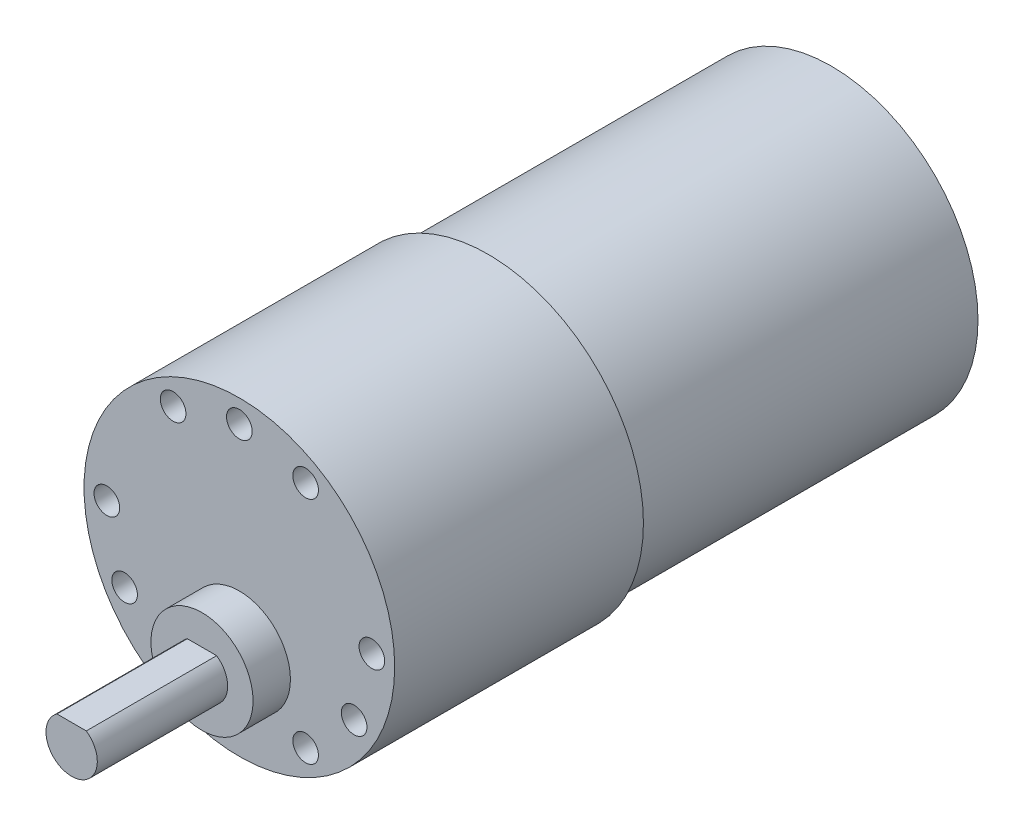
ISO-10303-21;
HEADER;
FILE_DESCRIPTION(('STEP AP214'),'2;1');
FILE_NAME('part.step','',(''),(''),'','','');
FILE_SCHEMA(('AUTOMOTIVE_DESIGN { 1 0 10303 214 1 1 1 1 }'));
ENDSEC;
DATA;
#1=APPLICATION_CONTEXT('core data for automotive mechanical design processes');
#2=APPLICATION_PROTOCOL_DEFINITION('international standard','automotive_design',2000,#1);
#3=PRODUCT_CONTEXT('',#1,'mechanical');
#4=PRODUCT('Part','Part','',(#3));
#5=PRODUCT_RELATED_PRODUCT_CATEGORY('part','',(#4));
#6=PRODUCT_DEFINITION_FORMATION('','',#4);
#7=PRODUCT_DEFINITION_CONTEXT('part definition',#1,'design');
#8=PRODUCT_DEFINITION('design','',#6,#7);
#9=PRODUCT_DEFINITION_SHAPE('','',#8);
#10=(LENGTH_UNIT() NAMED_UNIT(*) SI_UNIT(.MILLI.,.METRE.));
#11=(NAMED_UNIT(*) PLANE_ANGLE_UNIT() SI_UNIT($,.RADIAN.));
#12=(NAMED_UNIT(*) SI_UNIT($,.STERADIAN.) SOLID_ANGLE_UNIT());
#13=UNCERTAINTY_MEASURE_WITH_UNIT(LENGTH_MEASURE(1.E-05),#10,'distance_accuracy_value','');
#14=(GEOMETRIC_REPRESENTATION_CONTEXT(3) GLOBAL_UNCERTAINTY_ASSIGNED_CONTEXT((#13)) GLOBAL_UNIT_ASSIGNED_CONTEXT((#10,
#11,#12)) REPRESENTATION_CONTEXT('',''));
#15=CARTESIAN_POINT('',(0.,0.,0.));
#16=DIRECTION('',(0.,0.,1.));
#17=DIRECTION('',(1.,0.,0.));
#18=AXIS2_PLACEMENT_3D('',#15,#16,#17);
#19=CARTESIAN_POINT('',(0.,0.,-39.116));
#20=DIRECTION('',(0.,0.,-1.));
#21=DIRECTION('',(-1.,0.,0.));
#22=AXIS2_PLACEMENT_3D('',#19,#20,#21);
#23=PLANE('',#22);
#24=DIRECTION('',(0.642787609686543,-0.766044443118975,0.));
#25=VECTOR('',#24,1.);
#26=CARTESIAN_POINT('',(7.15248709016497,-8.91915603771026,-39.116));
#27=LINE('',#26,#25);
#28=CARTESIAN_POINT('',(5.51980656156115,-6.97340315218807,-39.116));
#29=VERTEX_POINT('',#28);
#30=CARTESIAN_POINT('',(7.15248709016497,-8.91915603771026,-39.116));
#31=VERTEX_POINT('',#30);
#32=EDGE_CURVE('E63',#29,#31,#27,.T.);
#33=ORIENTED_EDGE('',*,*,#32,.T.);
#34=DIRECTION('',(-0.766044443118975,-0.642787609686543,0.));
#35=VECTOR('',#34,1.);
#36=CARTESIAN_POINT('',(7.54163766726941,-8.5926199319895,-39.116));
#37=LINE('',#36,#35);
#38=CARTESIAN_POINT('',(7.54163766726941,-8.5926199319895,-39.116));
#39=VERTEX_POINT('',#38);
#40=EDGE_CURVE('E204',#39,#31,#37,.T.);
#41=ORIENTED_EDGE('',*,*,#40,.F.);
#42=DIRECTION('',(0.642787609686543,-0.766044443118975,0.));
#43=VECTOR('',#42,1.);
#44=CARTESIAN_POINT('',(7.54163766726941,-8.5926199319895,-39.116));
#45=LINE('',#44,#43);
#46=CARTESIAN_POINT('',(5.90895713866559,-6.6468670464673,-39.116));
#47=VERTEX_POINT('',#46);
#48=EDGE_CURVE('E179',#47,#39,#45,.T.);
#49=ORIENTED_EDGE('',*,*,#48,.F.);
#50=DIRECTION('',(-0.766044443118975,-0.642787609686543,0.));
#51=VECTOR('',#50,1.);
#52=CARTESIAN_POINT('',(5.90895713866559,-6.6468670464673,-39.116));
#53=LINE('',#52,#51);
#54=EDGE_CURVE('E189',#47,#29,#53,.T.);
#55=ORIENTED_EDGE('',*,*,#54,.T.);
#56=EDGE_LOOP('',(#33,#41,#49,#55));
#57=FACE_BOUND('',#56,.T.);
#58=CARTESIAN_POINT('',(0.,0.,-39.116));
#59=DIRECTION('',(0.,0.,-1.));
#60=DIRECTION('',(-1.,0.,0.));
#61=AXIS2_PLACEMENT_3D('',#58,#59,#60);
#62=CIRCLE('',#61,16.637);
#63=CARTESIAN_POINT('',(-16.637,0.,-39.116));
#64=VERTEX_POINT('',#63);
#65=EDGE_CURVE('E12',#64,#64,#62,.T.);
#66=ORIENTED_EDGE('',*,*,#65,.T.);
#67=EDGE_LOOP('',(#66));
#68=FACE_BOUND('',#67,.T.);
#69=DIRECTION('',(-0.258819045102518,-0.965925826289069,0.));
#70=VECTOR('',#69,1.);
#71=CARTESIAN_POINT('',(-2.87494665811901,-9.7480663576409,-39.116));
#72=LINE('',#71,#70);
#73=CARTESIAN_POINT('',(-2.87494665811901,-9.7480663576409,-39.116));
#74=VERTEX_POINT('',#73);
#75=CARTESIAN_POINT('',(-3.5323470326794,-12.2015179564151,-39.116));
#76=VERTEX_POINT('',#75);
#77=EDGE_CURVE('E55',#74,#76,#72,.T.);
#78=ORIENTED_EDGE('',*,*,#77,.T.);
#79=DIRECTION('',(-0.965925826289069,0.258819045102518,0.));
#80=VECTOR('',#79,1.);
#81=CARTESIAN_POINT('',(-3.04165671292456,-12.3329980313272,-39.116));
#82=LINE('',#81,#80);
#83=CARTESIAN_POINT('',(-3.04165671292456,-12.3329980313272,-39.116));
#84=VERTEX_POINT('',#83);
#85=EDGE_CURVE('E150',#84,#76,#82,.T.);
#86=ORIENTED_EDGE('',*,*,#85,.F.);
#87=DIRECTION('',(-0.258819045102518,-0.965925826289069,0.));
#88=VECTOR('',#87,1.);
#89=CARTESIAN_POINT('',(-2.38425633836416,-9.87954643255298,-39.116));
#90=LINE('',#89,#88);
#91=CARTESIAN_POINT('',(-2.38425633836416,-9.87954643255298,-39.116));
#92=VERTEX_POINT('',#91);
#93=EDGE_CURVE('E156',#92,#84,#90,.T.);
#94=ORIENTED_EDGE('',*,*,#93,.F.);
#95=DIRECTION('',(-0.965925826289069,0.258819045102518,0.));
#96=VECTOR('',#95,1.);
#97=CARTESIAN_POINT('',(-2.38425633836416,-9.87954643255298,-39.116));
#98=LINE('',#97,#96);
#99=EDGE_CURVE('E521',#92,#74,#98,.T.);
#100=ORIENTED_EDGE('',*,*,#99,.T.);
#101=EDGE_LOOP('',(#78,#86,#94,#100));
#102=FACE_BOUND('',#101,.T.);
#103=ADVANCED_FACE('F41',(#57,#68,#102),#23,.T.);
#104=CARTESIAN_POINT('',(0.,0.,-40.132));
#105=DIRECTION('',(0.,0.,-1.));
#106=DIRECTION('',(-1.,0.,0.));
#107=AXIS2_PLACEMENT_3D('',#104,#105,#106);
#108=PLANE('',#107);
#109=CARTESIAN_POINT('',(0.,0.,-40.132));
#110=DIRECTION('',(0.,0.,-1.));
#111=DIRECTION('',(-1.,0.,0.));
#112=AXIS2_PLACEMENT_3D('',#109,#110,#111);
#113=CIRCLE('',#112,16.637);
#114=CARTESIAN_POINT('',(-16.637,0.,-40.132));
#115=VERTEX_POINT('',#114);
#116=EDGE_CURVE('E48',#115,#115,#113,.T.);
#117=ORIENTED_EDGE('',*,*,#116,.F.);
#118=EDGE_LOOP('',(#117));
#119=FACE_BOUND('',#118,.T.);
#120=CARTESIAN_POINT('',(0.,0.,-40.132));
#121=DIRECTION('',(0.,0.,-1.));
#122=DIRECTION('',(-1.,0.,0.));
#123=AXIS2_PLACEMENT_3D('',#120,#121,#122);
#124=CIRCLE('',#123,17.145);
#125=CARTESIAN_POINT('',(-17.145,0.,-40.132));
#126=VERTEX_POINT('',#125);
#127=EDGE_CURVE('E207',#126,#126,#124,.T.);
#128=ORIENTED_EDGE('',*,*,#127,.T.);
#129=EDGE_LOOP('',(#128));
#130=FACE_BOUND('',#129,.T.);
#131=ADVANCED_FACE('F298',(#119,#130),#108,.T.);
#132=CARTESIAN_POINT('',(0.,0.,0.));
#133=DIRECTION('',(0.,0.,1.));
#134=DIRECTION('',(1.,0.,0.));
#135=AXIS2_PLACEMENT_3D('',#132,#133,#134);
#136=PLANE('',#135);
#137=CARTESIAN_POINT('',(0.,0.,0.));
#138=DIRECTION('',(0.,0.,1.));
#139=DIRECTION('',(1.,0.,0.));
#140=AXIS2_PLACEMENT_3D('',#137,#138,#139);
#141=CIRCLE('',#140,18.161);
#142=CARTESIAN_POINT('',(18.161,0.,0.));
#143=VERTEX_POINT('',#142);
#144=EDGE_CURVE('E212',#143,#143,#141,.T.);
#145=ORIENTED_EDGE('',*,*,#144,.F.);
#146=EDGE_LOOP('',(#145));
#147=FACE_BOUND('',#146,.T.);
#148=CARTESIAN_POINT('',(0.,0.,0.));
#149=DIRECTION('',(0.,0.,1.));
#150=DIRECTION('',(1.,0.,0.));
#151=AXIS2_PLACEMENT_3D('',#148,#149,#150);
#152=CIRCLE('',#151,17.145);
#153=CARTESIAN_POINT('',(17.145,0.,0.));
#154=VERTEX_POINT('',#153);
#155=EDGE_CURVE('E208',#154,#154,#152,.F.);
#156=ORIENTED_EDGE('',*,*,#155,.F.);
#157=EDGE_LOOP('',(#156));
#158=FACE_BOUND('',#157,.T.);
#159=ADVANCED_FACE('F301',(#147,#158),#136,.F.);
#160=CARTESIAN_POINT('',(0.,-7.366,33.4518));
#161=DIRECTION('',(0.,0.,1.));
#162=DIRECTION('',(1.,0.,0.));
#163=AXIS2_PLACEMENT_3D('',#160,#161,#162);
#164=PLANE('',#163);
#165=CARTESIAN_POINT('',(0.,-7.366,33.4518));
#166=DIRECTION('',(0.,0.,1.));
#167=DIRECTION('',(1.,0.,0.));
#168=AXIS2_PLACEMENT_3D('',#165,#166,#167);
#169=CIRCLE('',#168,5.969);
#170=CARTESIAN_POINT('',(5.969,-7.366,33.4518));
#171=VERTEX_POINT('',#170);
#172=EDGE_CURVE('E219',#171,#171,#169,.T.);
#173=ORIENTED_EDGE('',*,*,#172,.T.);
#174=EDGE_LOOP('',(#173));
#175=FACE_BOUND('',#174,.T.);
#176=DIRECTION('',(-1.,0.,0.));
#177=VECTOR('',#176,1.);
#178=CARTESIAN_POINT('',(-1.71565701700544,-4.905,33.4518));
#179=LINE('',#178,#177);
#180=CARTESIAN_POINT('',(1.71565701700544,-4.905,33.4518));
#181=VERTEX_POINT('',#180);
#182=CARTESIAN_POINT('',(-1.71565701700544,-4.905,33.4518));
#183=VERTEX_POINT('',#182);
#184=EDGE_CURVE('E229',#181,#183,#179,.T.);
#185=ORIENTED_EDGE('',*,*,#184,.F.);
#186=CARTESIAN_POINT('',(0.,-7.366,33.4518));
#187=DIRECTION('',(0.,0.,1.));
#188=DIRECTION('',(1.,0.,0.));
#189=AXIS2_PLACEMENT_3D('',#186,#187,#188);
#190=CIRCLE('',#189,3.);
#191=EDGE_CURVE('E222',#183,#181,#190,.T.);
#192=ORIENTED_EDGE('',*,*,#191,.F.);
#193=EDGE_LOOP('',(#185,#192));
#194=FACE_BOUND('',#193,.T.);
#195=ADVANCED_FACE('F313',(#175,#194),#164,.T.);
#196=CARTESIAN_POINT('',(0.,0.,29.083));
#197=DIRECTION('',(0.,0.,1.));
#198=DIRECTION('',(1.,0.,0.));
#199=AXIS2_PLACEMENT_3D('',#196,#197,#198);
#200=PLANE('',#199);
#201=CARTESIAN_POINT('',(-7.74699999999983,13.4181976062362,29.083));
#202=DIRECTION('',(0.,0.,1.));
#203=DIRECTION('',(1.,0.,0.));
#204=AXIS2_PLACEMENT_3D('',#201,#202,#203);
#205=CIRCLE('',#204,1.49999999999999);
#206=CARTESIAN_POINT('',(-6.24699999999984,13.4181976062362,29.083));
#207=VERTEX_POINT('',#206);
#208=EDGE_CURVE('E211',#207,#207,#205,.T.);
#209=ORIENTED_EDGE('',*,*,#208,.F.);
#210=EDGE_LOOP('',(#209));
#211=FACE_BOUND('',#210,.T.);
#212=CARTESIAN_POINT('',(-15.494,1.62291035592107E-13,29.083));
#213=DIRECTION('',(0.,0.,1.));
#214=DIRECTION('',(1.,0.,0.));
#215=AXIS2_PLACEMENT_3D('',#212,#213,#214);
#216=CIRCLE('',#215,1.49999999999999);
#217=CARTESIAN_POINT('',(-13.994,1.62291035592107E-13,29.083));
#218=VERTEX_POINT('',#217);
#219=EDGE_CURVE('E284',#218,#218,#216,.T.);
#220=ORIENTED_EDGE('',*,*,#219,.F.);
#221=EDGE_LOOP('',(#220));
#222=FACE_BOUND('',#221,.T.);
#223=CARTESIAN_POINT('',(-13.4181976062362,-7.74699999999987,29.083));
#224=DIRECTION('',(0.,0.,1.));
#225=DIRECTION('',(1.,0.,0.));
#226=AXIS2_PLACEMENT_3D('',#223,#224,#225);
#227=CIRCLE('',#226,1.49999999999999);
#228=CARTESIAN_POINT('',(-11.9181976062362,-7.74699999999987,29.083));
#229=VERTEX_POINT('',#228);
#230=EDGE_CURVE('E278',#229,#229,#227,.T.);
#231=ORIENTED_EDGE('',*,*,#230,.F.);
#232=EDGE_LOOP('',(#231));
#233=FACE_BOUND('',#232,.T.);
#234=CARTESIAN_POINT('',(-7.74700000000011,-13.418197606236,29.083));
#235=DIRECTION('',(0.,0.,1.));
#236=DIRECTION('',(1.,0.,0.));
#237=AXIS2_PLACEMENT_3D('',#234,#235,#236);
#238=CIRCLE('',#237,1.49999999999999);
#239=CARTESIAN_POINT('',(-6.24700000000012,-13.418197606236,29.083));
#240=VERTEX_POINT('',#239);
#241=EDGE_CURVE('E272',#240,#240,#238,.T.);
#242=ORIENTED_EDGE('',*,*,#241,.F.);
#243=EDGE_LOOP('',(#242));
#244=FACE_BOUND('',#243,.T.);
#245=CARTESIAN_POINT('',(7.74699999999992,-13.4181976062361,29.083));
#246=DIRECTION('',(0.,0.,1.));
#247=DIRECTION('',(1.,0.,0.));
#248=AXIS2_PLACEMENT_3D('',#245,#246,#247);
#249=CIRCLE('',#248,1.49999999999999);
#250=CARTESIAN_POINT('',(9.24699999999991,-13.4181976062361,29.083));
#251=VERTEX_POINT('',#250);
#252=EDGE_CURVE('E266',#251,#251,#249,.T.);
#253=ORIENTED_EDGE('',*,*,#252,.F.);
#254=EDGE_LOOP('',(#253));
#255=FACE_BOUND('',#254,.T.);
#256=CARTESIAN_POINT('',(13.4181976062361,-7.74700000000006,29.083));
#257=DIRECTION('',(0.,0.,1.));
#258=DIRECTION('',(1.,0.,0.));
#259=AXIS2_PLACEMENT_3D('',#256,#257,#258);
#260=CIRCLE('',#259,1.49999999999999);
#261=CARTESIAN_POINT('',(14.918197606236,-7.74700000000006,29.083));
#262=VERTEX_POINT('',#261);
#263=EDGE_CURVE('E260',#262,#262,#260,.T.);
#264=ORIENTED_EDGE('',*,*,#263,.F.);
#265=EDGE_LOOP('',(#264));
#266=FACE_BOUND('',#265,.T.);
#267=CARTESIAN_POINT('',(15.494,0.,29.083));
#268=DIRECTION('',(0.,0.,1.));
#269=DIRECTION('',(1.,0.,0.));
#270=AXIS2_PLACEMENT_3D('',#267,#268,#269);
#271=CIRCLE('',#270,1.49999999999999);
#272=CARTESIAN_POINT('',(16.994,0.,29.083));
#273=VERTEX_POINT('',#272);
#274=EDGE_CURVE('E254',#273,#273,#271,.T.);
#275=ORIENTED_EDGE('',*,*,#274,.F.);
#276=EDGE_LOOP('',(#275));
#277=FACE_BOUND('',#276,.T.);
#278=CARTESIAN_POINT('',(7.74700000000001,13.4181976062361,29.083));
#279=DIRECTION('',(0.,0.,1.));
#280=DIRECTION('',(1.,0.,0.));
#281=AXIS2_PLACEMENT_3D('',#278,#279,#280);
#282=CIRCLE('',#281,1.49999999999999);
#283=CARTESIAN_POINT('',(9.24700000000001,13.4181976062361,29.083));
#284=VERTEX_POINT('',#283);
#285=EDGE_CURVE('E248',#284,#284,#282,.T.);
#286=ORIENTED_EDGE('',*,*,#285,.F.);
#287=EDGE_LOOP('',(#286));
#288=FACE_BOUND('',#287,.T.);
#289=CARTESIAN_POINT('',(0.,15.494,29.083));
#290=DIRECTION('',(0.,0.,1.));
#291=DIRECTION('',(1.,0.,0.));
#292=AXIS2_PLACEMENT_3D('',#289,#290,#291);
#293=CIRCLE('',#292,1.49999999999999);
#294=CARTESIAN_POINT('',(1.49999999999999,15.494,29.083));
#295=VERTEX_POINT('',#294);
#296=EDGE_CURVE('E242',#295,#295,#293,.T.);
#297=ORIENTED_EDGE('',*,*,#296,.F.);
#298=EDGE_LOOP('',(#297));
#299=FACE_BOUND('',#298,.T.);
#300=CARTESIAN_POINT('',(0.,0.,29.083));
#301=DIRECTION('',(0.,0.,1.));
#302=DIRECTION('',(1.,0.,0.));
#303=AXIS2_PLACEMENT_3D('',#300,#301,#302);
#304=CIRCLE('',#303,18.161);
#305=CARTESIAN_POINT('',(18.161,0.,29.083));
#306=VERTEX_POINT('',#305);
#307=EDGE_CURVE('E216',#306,#306,#304,.T.);
#308=ORIENTED_EDGE('',*,*,#307,.T.);
#309=EDGE_LOOP('',(#308));
#310=FACE_BOUND('',#309,.T.);
#311=CARTESIAN_POINT('',(0.,-7.366,29.083));
#312=DIRECTION('',(0.,0.,1.));
#313=DIRECTION('',(1.,0.,0.));
#314=AXIS2_PLACEMENT_3D('',#311,#312,#313);
#315=CIRCLE('',#314,5.969);
#316=CARTESIAN_POINT('',(5.969,-7.366,29.083));
#317=VERTEX_POINT('',#316);
#318=EDGE_CURVE('E215',#317,#317,#315,.T.);
#319=ORIENTED_EDGE('',*,*,#318,.F.);
#320=EDGE_LOOP('',(#319));
#321=FACE_BOUND('',#320,.T.);
#322=ADVANCED_FACE('F319',(#211,#222,#233,#244,#255,#266,#277,#288,#299,#310,#321),#200,.T.);
#323=CARTESIAN_POINT('',(0.,0.,29.083));
#324=DIRECTION('',(0.,0.,-1.));
#325=DIRECTION('',(-1.,0.,0.));
#326=AXIS2_PLACEMENT_3D('',#323,#324,#325);
#327=CYLINDRICAL_SURFACE('',#326,18.161);
#328=ORIENTED_EDGE('',*,*,#307,.F.);
#329=EDGE_LOOP('',(#328));
#330=FACE_BOUND('',#329,.T.);
#331=ORIENTED_EDGE('',*,*,#144,.T.);
#332=EDGE_LOOP('',(#331));
#333=FACE_BOUND('',#332,.T.);
#334=ADVANCED_FACE('F427',(#330,#333),#327,.T.);
#335=CARTESIAN_POINT('',(0.,-7.366,33.4518));
#336=DIRECTION('',(0.,0.,-1.));
#337=DIRECTION('',(-1.,0.,0.));
#338=AXIS2_PLACEMENT_3D('',#335,#336,#337);
#339=CYLINDRICAL_SURFACE('',#338,5.969);
#340=ORIENTED_EDGE('',*,*,#172,.F.);
#341=EDGE_LOOP('',(#340));
#342=FACE_BOUND('',#341,.T.);
#343=ORIENTED_EDGE('',*,*,#318,.T.);
#344=EDGE_LOOP('',(#343));
#345=FACE_BOUND('',#344,.T.);
#346=ADVANCED_FACE('F423',(#342,#345),#339,.T.);
#347=CARTESIAN_POINT('',(0.,-7.366,48.6918));
#348=DIRECTION('',(0.,0.,-1.));
#349=DIRECTION('',(-1.,0.,0.));
#350=AXIS2_PLACEMENT_3D('',#347,#348,#349);
#351=CYLINDRICAL_SURFACE('',#350,3.);
#352=ORIENTED_EDGE('',*,*,#191,.T.);
#353=DIRECTION('',(0.,0.,-1.));
#354=VECTOR('',#353,1.);
#355=CARTESIAN_POINT('',(1.71565701700544,-4.905,48.6918));
#356=LINE('',#355,#354);
#357=CARTESIAN_POINT('',(1.71565701700544,-4.905,48.6918));
#358=VERTEX_POINT('',#357);
#359=EDGE_CURVE('E225',#358,#181,#356,.T.);
#360=ORIENTED_EDGE('',*,*,#359,.F.);
#361=CARTESIAN_POINT('',(0.,-7.366,48.6918));
#362=DIRECTION('',(0.,0.,1.));
#363=DIRECTION('',(1.,0.,0.));
#364=AXIS2_PLACEMENT_3D('',#361,#362,#363);
#365=CIRCLE('',#364,3.);
#366=CARTESIAN_POINT('',(-1.71565701700544,-4.905,48.6918));
#367=VERTEX_POINT('',#366);
#368=EDGE_CURVE('E228',#367,#358,#365,.T.);
#369=ORIENTED_EDGE('',*,*,#368,.F.);
#370=DIRECTION('',(0.,0.,-1.));
#371=VECTOR('',#370,1.);
#372=CARTESIAN_POINT('',(-1.71565701700544,-4.905,48.6918));
#373=LINE('',#372,#371);
#374=EDGE_CURVE('E230',#367,#183,#373,.T.);
#375=ORIENTED_EDGE('',*,*,#374,.T.);
#376=EDGE_LOOP('',(#352,#360,#369,#375));
#377=FACE_BOUND('',#376,.T.);
#378=ADVANCED_FACE('F420',(#377),#351,.T.);
#379=CARTESIAN_POINT('',(-1.71565701700544,-4.905,48.6918));
#380=DIRECTION('',(0.,-1.,0.));
#381=DIRECTION('',(0.,0.,-1.));
#382=AXIS2_PLACEMENT_3D('',#379,#380,#381);
#383=PLANE('',#382);
#384=ORIENTED_EDGE('',*,*,#184,.T.);
#385=ORIENTED_EDGE('',*,*,#374,.F.);
#386=DIRECTION('',(-1.,0.,0.));
#387=VECTOR('',#386,1.);
#388=CARTESIAN_POINT('',(-1.71565701700544,-4.905,48.6918));
#389=LINE('',#388,#387);
#390=EDGE_CURVE('E235',#358,#367,#389,.T.);
#391=ORIENTED_EDGE('',*,*,#390,.F.);
#392=ORIENTED_EDGE('',*,*,#359,.T.);
#393=EDGE_LOOP('',(#384,#385,#391,#392));
#394=FACE_BOUND('',#393,.T.);
#395=ADVANCED_FACE('F416',(#394),#383,.F.);
#396=CARTESIAN_POINT('',(0.,-7.366,48.6918));
#397=DIRECTION('',(0.,0.,1.));
#398=DIRECTION('',(1.,0.,0.));
#399=AXIS2_PLACEMENT_3D('',#396,#397,#398);
#400=PLANE('',#399);
#401=ORIENTED_EDGE('',*,*,#368,.T.);
#402=ORIENTED_EDGE('',*,*,#390,.T.);
#403=EDGE_LOOP('',(#401,#402));
#404=FACE_BOUND('',#403,.T.);
#405=ADVANCED_FACE('F412',(#404),#400,.T.);
#406=CARTESIAN_POINT('',(0.,15.494,18.923));
#407=DIRECTION('',(0.,0.,1.));
#408=DIRECTION('',(1.,0.,0.));
#409=AXIS2_PLACEMENT_3D('',#406,#407,#408);
#410=CONICAL_SURFACE('',#409,1.49999999999999,1.02974425867665);
#411=CARTESIAN_POINT('',(0.,15.494,18.0217090714587));
#412=VERTEX_POINT('',#411);
#413=VERTEX_LOOP('',#412);
#414=FACE_BOUND('',#413,.T.);
#415=CARTESIAN_POINT('',(0.,15.494,18.923));
#416=DIRECTION('',(0.,0.,1.));
#417=DIRECTION('',(1.,0.,0.));
#418=AXIS2_PLACEMENT_3D('',#415,#416,#417);
#419=CIRCLE('',#418,1.49999999999999);
#420=CARTESIAN_POINT('',(1.49999999999999,15.494,18.923));
#421=VERTEX_POINT('',#420);
#422=EDGE_CURVE('E237',#421,#421,#419,.T.);
#423=ORIENTED_EDGE('',*,*,#422,.T.);
#424=EDGE_LOOP('',(#423));
#425=FACE_BOUND('',#424,.T.);
#426=ADVANCED_FACE('F408',(#414,#425),#410,.F.);
#427=CARTESIAN_POINT('',(0.,15.494,29.083));
#428=DIRECTION('',(0.,0.,1.));
#429=DIRECTION('',(1.,0.,0.));
#430=AXIS2_PLACEMENT_3D('',#427,#428,#429);
#431=CYLINDRICAL_SURFACE('',#430,1.49999999999999);
#432=ORIENTED_EDGE('',*,*,#422,.F.);
#433=EDGE_LOOP('',(#432));
#434=FACE_BOUND('',#433,.T.);
#435=ORIENTED_EDGE('',*,*,#296,.T.);
#436=EDGE_LOOP('',(#435));
#437=FACE_BOUND('',#436,.T.);
#438=ADVANCED_FACE('F404',(#434,#437),#431,.F.);
#439=CARTESIAN_POINT('',(7.74700000000001,13.4181976062361,18.923));
#440=DIRECTION('',(0.,0.,1.));
#441=DIRECTION('',(1.,0.,0.));
#442=AXIS2_PLACEMENT_3D('',#439,#440,#441);
#443=CONICAL_SURFACE('',#442,1.49999999999999,1.02974425867665);
#444=CARTESIAN_POINT('',(7.74700000000001,13.4181976062361,18.0217090714587));
#445=VERTEX_POINT('',#444);
#446=VERTEX_LOOP('',#445);
#447=FACE_BOUND('',#446,.T.);
#448=CARTESIAN_POINT('',(7.74700000000001,13.4181976062361,18.923));
#449=DIRECTION('',(0.,0.,1.));
#450=DIRECTION('',(1.,0.,0.));
#451=AXIS2_PLACEMENT_3D('',#448,#449,#450);
#452=CIRCLE('',#451,1.49999999999999);
#453=CARTESIAN_POINT('',(9.247,13.4181976062361,18.923));
#454=VERTEX_POINT('',#453);
#455=EDGE_CURVE('E245',#454,#454,#452,.T.);
#456=ORIENTED_EDGE('',*,*,#455,.T.);
#457=EDGE_LOOP('',(#456));
#458=FACE_BOUND('',#457,.T.);
#459=ADVANCED_FACE('F400',(#447,#458),#443,.F.);
#460=CARTESIAN_POINT('',(7.74700000000001,13.4181976062361,29.083));
#461=DIRECTION('',(0.,0.,1.));
#462=DIRECTION('',(1.,0.,0.));
#463=AXIS2_PLACEMENT_3D('',#460,#461,#462);
#464=CYLINDRICAL_SURFACE('',#463,1.49999999999999);
#465=ORIENTED_EDGE('',*,*,#455,.F.);
#466=EDGE_LOOP('',(#465));
#467=FACE_BOUND('',#466,.T.);
#468=ORIENTED_EDGE('',*,*,#285,.T.);
#469=EDGE_LOOP('',(#468));
#470=FACE_BOUND('',#469,.T.);
#471=ADVANCED_FACE('F396',(#467,#470),#464,.F.);
#472=CARTESIAN_POINT('',(15.494,0.,18.923));
#473=DIRECTION('',(0.,0.,1.));
#474=DIRECTION('',(1.,0.,0.));
#475=AXIS2_PLACEMENT_3D('',#472,#473,#474);
#476=CONICAL_SURFACE('',#475,1.49999999999999,1.02974425867665);
#477=CARTESIAN_POINT('',(15.494,0.,18.0217090714587));
#478=VERTEX_POINT('',#477);
#479=VERTEX_LOOP('',#478);
#480=FACE_BOUND('',#479,.T.);
#481=CARTESIAN_POINT('',(15.494,0.,18.923));
#482=DIRECTION('',(0.,0.,1.));
#483=DIRECTION('',(1.,0.,0.));
#484=AXIS2_PLACEMENT_3D('',#481,#482,#483);
#485=CIRCLE('',#484,1.49999999999999);
#486=CARTESIAN_POINT('',(16.994,0.,18.923));
#487=VERTEX_POINT('',#486);
#488=EDGE_CURVE('E251',#487,#487,#485,.T.);
#489=ORIENTED_EDGE('',*,*,#488,.T.);
#490=EDGE_LOOP('',(#489));
#491=FACE_BOUND('',#490,.T.);
#492=ADVANCED_FACE('F392',(#480,#491),#476,.F.);
#493=CARTESIAN_POINT('',(15.494,0.,29.083));
#494=DIRECTION('',(0.,0.,1.));
#495=DIRECTION('',(1.,0.,0.));
#496=AXIS2_PLACEMENT_3D('',#493,#494,#495);
#497=CYLINDRICAL_SURFACE('',#496,1.49999999999999);
#498=ORIENTED_EDGE('',*,*,#488,.F.);
#499=EDGE_LOOP('',(#498));
#500=FACE_BOUND('',#499,.T.);
#501=ORIENTED_EDGE('',*,*,#274,.T.);
#502=EDGE_LOOP('',(#501));
#503=FACE_BOUND('',#502,.T.);
#504=ADVANCED_FACE('F388',(#500,#503),#497,.F.);
#505=CARTESIAN_POINT('',(13.4181976062361,-7.74700000000006,18.923));
#506=DIRECTION('',(0.,0.,1.));
#507=DIRECTION('',(1.,0.,0.));
#508=AXIS2_PLACEMENT_3D('',#505,#506,#507);
#509=CONICAL_SURFACE('',#508,1.49999999999999,1.02974425867665);
#510=CARTESIAN_POINT('',(13.4181976062361,-7.74700000000006,18.0217090714587));
#511=VERTEX_POINT('',#510);
#512=VERTEX_LOOP('',#511);
#513=FACE_BOUND('',#512,.T.);
#514=CARTESIAN_POINT('',(13.4181976062361,-7.74700000000006,18.923));
#515=DIRECTION('',(0.,0.,1.));
#516=DIRECTION('',(1.,0.,0.));
#517=AXIS2_PLACEMENT_3D('',#514,#515,#516);
#518=CIRCLE('',#517,1.49999999999999);
#519=CARTESIAN_POINT('',(14.918197606236,-7.74700000000006,18.923));
#520=VERTEX_POINT('',#519);
#521=EDGE_CURVE('E257',#520,#520,#518,.T.);
#522=ORIENTED_EDGE('',*,*,#521,.T.);
#523=EDGE_LOOP('',(#522));
#524=FACE_BOUND('',#523,.T.);
#525=ADVANCED_FACE('F384',(#513,#524),#509,.F.);
#526=CARTESIAN_POINT('',(13.4181976062361,-7.74700000000006,29.083));
#527=DIRECTION('',(0.,0.,1.));
#528=DIRECTION('',(1.,0.,0.));
#529=AXIS2_PLACEMENT_3D('',#526,#527,#528);
#530=CYLINDRICAL_SURFACE('',#529,1.49999999999999);
#531=ORIENTED_EDGE('',*,*,#521,.F.);
#532=EDGE_LOOP('',(#531));
#533=FACE_BOUND('',#532,.T.);
#534=ORIENTED_EDGE('',*,*,#263,.T.);
#535=EDGE_LOOP('',(#534));
#536=FACE_BOUND('',#535,.T.);
#537=ADVANCED_FACE('F380',(#533,#536),#530,.F.);
#538=CARTESIAN_POINT('',(7.74699999999992,-13.4181976062361,18.923));
#539=DIRECTION('',(0.,0.,1.));
#540=DIRECTION('',(1.,0.,0.));
#541=AXIS2_PLACEMENT_3D('',#538,#539,#540);
#542=CONICAL_SURFACE('',#541,1.49999999999999,1.02974425867665);
#543=CARTESIAN_POINT('',(7.74699999999992,-13.4181976062361,18.0217090714587));
#544=VERTEX_POINT('',#543);
#545=VERTEX_LOOP('',#544);
#546=FACE_BOUND('',#545,.T.);
#547=CARTESIAN_POINT('',(7.74699999999992,-13.4181976062361,18.923));
#548=DIRECTION('',(0.,0.,1.));
#549=DIRECTION('',(1.,0.,0.));
#550=AXIS2_PLACEMENT_3D('',#547,#548,#549);
#551=CIRCLE('',#550,1.49999999999999);
#552=CARTESIAN_POINT('',(9.24699999999991,-13.4181976062361,18.923));
#553=VERTEX_POINT('',#552);
#554=EDGE_CURVE('E263',#553,#553,#551,.T.);
#555=ORIENTED_EDGE('',*,*,#554,.T.);
#556=EDGE_LOOP('',(#555));
#557=FACE_BOUND('',#556,.T.);
#558=ADVANCED_FACE('F376',(#546,#557),#542,.F.);
#559=CARTESIAN_POINT('',(7.74699999999992,-13.4181976062361,29.083));
#560=DIRECTION('',(0.,0.,1.));
#561=DIRECTION('',(1.,0.,0.));
#562=AXIS2_PLACEMENT_3D('',#559,#560,#561);
#563=CYLINDRICAL_SURFACE('',#562,1.49999999999999);
#564=ORIENTED_EDGE('',*,*,#554,.F.);
#565=EDGE_LOOP('',(#564));
#566=FACE_BOUND('',#565,.T.);
#567=ORIENTED_EDGE('',*,*,#252,.T.);
#568=EDGE_LOOP('',(#567));
#569=FACE_BOUND('',#568,.T.);
#570=ADVANCED_FACE('F372',(#566,#569),#563,.F.);
#571=CARTESIAN_POINT('',(-7.74700000000011,-13.418197606236,18.923));
#572=DIRECTION('',(0.,0.,1.));
#573=DIRECTION('',(1.,0.,0.));
#574=AXIS2_PLACEMENT_3D('',#571,#572,#573);
#575=CONICAL_SURFACE('',#574,1.49999999999999,1.02974425867665);
#576=CARTESIAN_POINT('',(-7.74700000000011,-13.418197606236,18.0217090714587));
#577=VERTEX_POINT('',#576);
#578=VERTEX_LOOP('',#577);
#579=FACE_BOUND('',#578,.T.);
#580=CARTESIAN_POINT('',(-7.74700000000011,-13.418197606236,18.923));
#581=DIRECTION('',(0.,0.,1.));
#582=DIRECTION('',(1.,0.,0.));
#583=AXIS2_PLACEMENT_3D('',#580,#581,#582);
#584=CIRCLE('',#583,1.49999999999999);
#585=CARTESIAN_POINT('',(-6.24700000000012,-13.418197606236,18.923));
#586=VERTEX_POINT('',#585);
#587=EDGE_CURVE('E269',#586,#586,#584,.T.);
#588=ORIENTED_EDGE('',*,*,#587,.T.);
#589=EDGE_LOOP('',(#588));
#590=FACE_BOUND('',#589,.T.);
#591=ADVANCED_FACE('F368',(#579,#590),#575,.F.);
#592=CARTESIAN_POINT('',(-7.74700000000011,-13.418197606236,29.083));
#593=DIRECTION('',(0.,0.,1.));
#594=DIRECTION('',(1.,0.,0.));
#595=AXIS2_PLACEMENT_3D('',#592,#593,#594);
#596=CYLINDRICAL_SURFACE('',#595,1.49999999999999);
#597=ORIENTED_EDGE('',*,*,#587,.F.);
#598=EDGE_LOOP('',(#597));
#599=FACE_BOUND('',#598,.T.);
#600=ORIENTED_EDGE('',*,*,#241,.T.);
#601=EDGE_LOOP('',(#600));
#602=FACE_BOUND('',#601,.T.);
#603=ADVANCED_FACE('F364',(#599,#602),#596,.F.);
#604=CARTESIAN_POINT('',(-13.4181976062362,-7.74699999999987,18.923));
#605=DIRECTION('',(0.,0.,1.));
#606=DIRECTION('',(1.,0.,0.));
#607=AXIS2_PLACEMENT_3D('',#604,#605,#606);
#608=CONICAL_SURFACE('',#607,1.49999999999999,1.02974425867665);
#609=CARTESIAN_POINT('',(-13.4181976062362,-7.74699999999987,18.0217090714587));
#610=VERTEX_POINT('',#609);
#611=VERTEX_LOOP('',#610);
#612=FACE_BOUND('',#611,.T.);
#613=CARTESIAN_POINT('',(-13.4181976062362,-7.74699999999987,18.923));
#614=DIRECTION('',(0.,0.,1.));
#615=DIRECTION('',(1.,0.,0.));
#616=AXIS2_PLACEMENT_3D('',#613,#614,#615);
#617=CIRCLE('',#616,1.49999999999999);
#618=CARTESIAN_POINT('',(-11.9181976062362,-7.74699999999987,18.923));
#619=VERTEX_POINT('',#618);
#620=EDGE_CURVE('E275',#619,#619,#617,.T.);
#621=ORIENTED_EDGE('',*,*,#620,.T.);
#622=EDGE_LOOP('',(#621));
#623=FACE_BOUND('',#622,.T.);
#624=ADVANCED_FACE('F360',(#612,#623),#608,.F.);
#625=CARTESIAN_POINT('',(-13.4181976062362,-7.74699999999987,29.083));
#626=DIRECTION('',(0.,0.,1.));
#627=DIRECTION('',(1.,0.,0.));
#628=AXIS2_PLACEMENT_3D('',#625,#626,#627);
#629=CYLINDRICAL_SURFACE('',#628,1.49999999999999);
#630=ORIENTED_EDGE('',*,*,#620,.F.);
#631=EDGE_LOOP('',(#630));
#632=FACE_BOUND('',#631,.T.);
#633=ORIENTED_EDGE('',*,*,#230,.T.);
#634=EDGE_LOOP('',(#633));
#635=FACE_BOUND('',#634,.T.);
#636=ADVANCED_FACE('F356',(#632,#635),#629,.F.);
#637=CARTESIAN_POINT('',(-15.494,1.62291035592107E-13,18.923));
#638=DIRECTION('',(0.,0.,1.));
#639=DIRECTION('',(1.,0.,0.));
#640=AXIS2_PLACEMENT_3D('',#637,#638,#639);
#641=CONICAL_SURFACE('',#640,1.49999999999999,1.02974425867665);
#642=CARTESIAN_POINT('',(-15.494,1.62291035592107E-13,18.0217090714587));
#643=VERTEX_POINT('',#642);
#644=VERTEX_LOOP('',#643);
#645=FACE_BOUND('',#644,.T.);
#646=CARTESIAN_POINT('',(-15.494,1.62291035592107E-13,18.923));
#647=DIRECTION('',(0.,0.,1.));
#648=DIRECTION('',(1.,0.,0.));
#649=AXIS2_PLACEMENT_3D('',#646,#647,#648);
#650=CIRCLE('',#649,1.49999999999999);
#651=CARTESIAN_POINT('',(-13.994,1.62291035592107E-13,18.923));
#652=VERTEX_POINT('',#651);
#653=EDGE_CURVE('E281',#652,#652,#650,.T.);
#654=ORIENTED_EDGE('',*,*,#653,.T.);
#655=EDGE_LOOP('',(#654));
#656=FACE_BOUND('',#655,.T.);
#657=ADVANCED_FACE('F352',(#645,#656),#641,.F.);
#658=CARTESIAN_POINT('',(-15.494,1.62291035592107E-13,29.083));
#659=DIRECTION('',(0.,0.,1.));
#660=DIRECTION('',(1.,0.,0.));
#661=AXIS2_PLACEMENT_3D('',#658,#659,#660);
#662=CYLINDRICAL_SURFACE('',#661,1.49999999999999);
#663=ORIENTED_EDGE('',*,*,#653,.F.);
#664=EDGE_LOOP('',(#663));
#665=FACE_BOUND('',#664,.T.);
#666=ORIENTED_EDGE('',*,*,#219,.T.);
#667=EDGE_LOOP('',(#666));
#668=FACE_BOUND('',#667,.T.);
#669=ADVANCED_FACE('F348',(#665,#668),#662,.F.);
#670=CARTESIAN_POINT('',(-7.74699999999983,13.4181976062362,18.923));
#671=DIRECTION('',(0.,0.,1.));
#672=DIRECTION('',(1.,0.,0.));
#673=AXIS2_PLACEMENT_3D('',#670,#671,#672);
#674=CONICAL_SURFACE('',#673,1.49999999999999,1.02974425867665);
#675=CARTESIAN_POINT('',(-7.74699999999983,13.4181976062362,18.0217090714587));
#676=VERTEX_POINT('',#675);
#677=VERTEX_LOOP('',#676);
#678=FACE_BOUND('',#677,.T.);
#679=CARTESIAN_POINT('',(-7.74699999999983,13.4181976062362,18.923));
#680=DIRECTION('',(0.,0.,1.));
#681=DIRECTION('',(1.,0.,0.));
#682=AXIS2_PLACEMENT_3D('',#679,#680,#681);
#683=CIRCLE('',#682,1.49999999999999);
#684=CARTESIAN_POINT('',(-6.24699999999984,13.4181976062362,18.923));
#685=VERTEX_POINT('',#684);
#686=EDGE_CURVE('E287',#685,#685,#683,.T.);
#687=ORIENTED_EDGE('',*,*,#686,.T.);
#688=EDGE_LOOP('',(#687));
#689=FACE_BOUND('',#688,.T.);
#690=ADVANCED_FACE('F344',(#678,#689),#674,.F.);
#691=CARTESIAN_POINT('',(-7.74699999999983,13.4181976062362,29.083));
#692=DIRECTION('',(0.,0.,1.));
#693=DIRECTION('',(1.,0.,0.));
#694=AXIS2_PLACEMENT_3D('',#691,#692,#693);
#695=CYLINDRICAL_SURFACE('',#694,1.49999999999999);
#696=ORIENTED_EDGE('',*,*,#686,.F.);
#697=EDGE_LOOP('',(#696));
#698=FACE_BOUND('',#697,.T.);
#699=ORIENTED_EDGE('',*,*,#208,.T.);
#700=EDGE_LOOP('',(#699));
#701=FACE_BOUND('',#700,.T.);
#702=ADVANCED_FACE('F308',(#698,#701),#695,.F.);
#703=CARTESIAN_POINT('',(0.,0.,-40.132));
#704=DIRECTION('',(0.,0.,1.));
#705=DIRECTION('',(1.,0.,0.));
#706=AXIS2_PLACEMENT_3D('',#703,#704,#705);
#707=CYLINDRICAL_SURFACE('',#706,17.145);
#708=ORIENTED_EDGE('',*,*,#127,.F.);
#709=EDGE_LOOP('',(#708));
#710=FACE_BOUND('',#709,.T.);
#711=ORIENTED_EDGE('',*,*,#155,.T.);
#712=EDGE_LOOP('',(#711));
#713=FACE_BOUND('',#712,.T.);
#714=ADVANCED_FACE('F305',(#710,#713),#707,.T.);
#715=CARTESIAN_POINT('',(0.,0.,-39.116));
#716=DIRECTION('',(0.,0.,-1.));
#717=DIRECTION('',(-1.,0.,0.));
#718=AXIS2_PLACEMENT_3D('',#715,#716,#717);
#719=CYLINDRICAL_SURFACE('',#718,16.637);
#720=ORIENTED_EDGE('',*,*,#65,.F.);
#721=EDGE_LOOP('',(#720));
#722=FACE_BOUND('',#721,.T.);
#723=ORIENTED_EDGE('',*,*,#116,.T.);
#724=EDGE_LOOP('',(#723));
#725=FACE_BOUND('',#724,.T.);
#726=ADVANCED_FACE('F296',(#722,#725),#719,.F.);
#727=CARTESIAN_POINT('',(0.19457528855222,0.163268052860382,0.));
#728=DIRECTION('',(-0.766044443118975,-0.642787609686543,0.));
#729=DIRECTION('',(0.642787609686543,-0.766044443118975,0.));
#730=AXIS2_PLACEMENT_3D('',#727,#728,#729);
#731=PLANE('',#730);
#732=ORIENTED_EDGE('',*,*,#48,.T.);
#733=DIRECTION('',(0.,0.,-1.));
#734=VECTOR('',#733,1.);
#735=CARTESIAN_POINT('',(7.54163766726941,-8.5926199319895,-44.196));
#736=LINE('',#735,#734);
#737=CARTESIAN_POINT('',(7.54163766726941,-8.5926199319895,-44.196));
#738=VERTEX_POINT('',#737);
#739=EDGE_CURVE('E182',#39,#738,#736,.T.);
#740=ORIENTED_EDGE('',*,*,#739,.T.);
#741=DIRECTION('',(-0.642787609686543,0.766044443118975,0.));
#742=VECTOR('',#741,1.);
#743=CARTESIAN_POINT('',(5.90895713866559,-6.6468670464673,-44.196));
#744=LINE('',#743,#742);
#745=CARTESIAN_POINT('',(5.90895713866559,-6.6468670464673,-44.196));
#746=VERTEX_POINT('',#745);
#747=EDGE_CURVE('E185',#738,#746,#744,.T.);
#748=ORIENTED_EDGE('',*,*,#747,.T.);
#749=DIRECTION('',(0.,0.,1.));
#750=VECTOR('',#749,1.);
#751=CARTESIAN_POINT('',(5.90895713866559,-6.6468670464673,-39.116));
#752=LINE('',#751,#750);
#753=EDGE_CURVE('E187',#746,#47,#752,.T.);
#754=ORIENTED_EDGE('',*,*,#753,.T.);
#755=EDGE_LOOP('',(#732,#740,#748,#754));
#756=FACE_BOUND('',#755,.T.);
#757=CARTESIAN_POINT('',(6.7252974029675,-7.6197434892284,-42.926));
#758=DIRECTION('',(0.766044443118975,0.642787609686543,0.));
#759=DIRECTION('',(-0.642787609686543,0.766044443118975,0.));
#760=AXIS2_PLACEMENT_3D('',#757,#758,#759);
#761=CIRCLE('',#760,0.4445);
#762=CARTESIAN_POINT('',(6.43957831046183,-7.27923673426202,-42.926));
#763=VERTEX_POINT('',#762);
#764=EDGE_CURVE('E171',#763,#763,#761,.T.);
#765=ORIENTED_EDGE('',*,*,#764,.F.);
#766=EDGE_LOOP('',(#765));
#767=FACE_BOUND('',#766,.T.);
#768=ADVANCED_FACE('F334',(#756,#767),#731,.F.);
#769=CARTESIAN_POINT('',(-0.19457528855222,-0.163268052860382,0.));
#770=DIRECTION('',(-0.766044443118975,-0.642787609686543,0.));
#771=DIRECTION('',(0.642787609686543,-0.766044443118975,0.));
#772=AXIS2_PLACEMENT_3D('',#769,#770,#771);
#773=PLANE('',#772);
#774=ORIENTED_EDGE('',*,*,#32,.F.);
#775=DIRECTION('',(0.,0.,1.));
#776=VECTOR('',#775,1.);
#777=CARTESIAN_POINT('',(5.51980656156115,-6.97340315218807,-39.116));
#778=LINE('',#777,#776);
#779=CARTESIAN_POINT('',(5.51980656156115,-6.97340315218807,-44.196));
#780=VERTEX_POINT('',#779);
#781=EDGE_CURVE('E183',#780,#29,#778,.T.);
#782=ORIENTED_EDGE('',*,*,#781,.F.);
#783=DIRECTION('',(-0.642787609686543,0.766044443118975,0.));
#784=VECTOR('',#783,1.);
#785=CARTESIAN_POINT('',(5.51980656156115,-6.97340315218807,-44.196));
#786=LINE('',#785,#784);
#787=CARTESIAN_POINT('',(7.15248709016497,-8.91915603771026,-44.196));
#788=VERTEX_POINT('',#787);
#789=EDGE_CURVE('E193',#788,#780,#786,.T.);
#790=ORIENTED_EDGE('',*,*,#789,.F.);
#791=DIRECTION('',(0.,0.,-1.));
#792=VECTOR('',#791,1.);
#793=CARTESIAN_POINT('',(7.15248709016497,-8.91915603771026,-44.196));
#794=LINE('',#793,#792);
#795=EDGE_CURVE('E191',#31,#788,#794,.T.);
#796=ORIENTED_EDGE('',*,*,#795,.F.);
#797=EDGE_LOOP('',(#774,#782,#790,#796));
#798=FACE_BOUND('',#797,.T.);
#799=CARTESIAN_POINT('',(6.33614682586306,-7.94627959494917,-42.926));
#800=DIRECTION('',(0.766044443118975,0.642787609686543,0.));
#801=DIRECTION('',(-0.642787609686543,0.766044443118975,0.));
#802=AXIS2_PLACEMENT_3D('',#799,#800,#801);
#803=CIRCLE('',#802,0.4445);
#804=CARTESIAN_POINT('',(6.0504277333574,-7.60577283998278,-42.926));
#805=VERTEX_POINT('',#804);
#806=EDGE_CURVE('E168',#805,#805,#803,.T.);
#807=ORIENTED_EDGE('',*,*,#806,.T.);
#808=EDGE_LOOP('',(#807));
#809=FACE_BOUND('',#808,.T.);
#810=ADVANCED_FACE('F338',(#798,#809),#773,.T.);
#811=CARTESIAN_POINT('',(7.54163766726941,-8.5926199319895,-44.196));
#812=DIRECTION('',(-0.642787609686543,0.766044443118975,0.));
#813=DIRECTION('',(-0.766044443118975,-0.642787609686543,0.));
#814=AXIS2_PLACEMENT_3D('',#811,#812,#813);
#815=PLANE('',#814);
#816=ORIENTED_EDGE('',*,*,#795,.T.);
#817=DIRECTION('',(-0.766044443118975,-0.642787609686543,0.));
#818=VECTOR('',#817,1.);
#819=CARTESIAN_POINT('',(7.54163766726941,-8.5926199319895,-44.196));
#820=LINE('',#819,#818);
#821=EDGE_CURVE('E201',#738,#788,#820,.T.);
#822=ORIENTED_EDGE('',*,*,#821,.F.);
#823=ORIENTED_EDGE('',*,*,#739,.F.);
#824=ORIENTED_EDGE('',*,*,#40,.T.);
#825=EDGE_LOOP('',(#816,#822,#823,#824));
#826=FACE_BOUND('',#825,.T.);
#827=ADVANCED_FACE('F470',(#826),#815,.F.);
#828=CARTESIAN_POINT('',(5.90895713866559,-6.6468670464673,-44.196));
#829=DIRECTION('',(0.,0.,1.));
#830=DIRECTION('',(1.,0.,0.));
#831=AXIS2_PLACEMENT_3D('',#828,#829,#830);
#832=PLANE('',#831);
#833=ORIENTED_EDGE('',*,*,#789,.T.);
#834=DIRECTION('',(-0.766044443118975,-0.642787609686543,0.));
#835=VECTOR('',#834,1.);
#836=CARTESIAN_POINT('',(5.90895713866559,-6.6468670464673,-44.196));
#837=LINE('',#836,#835);
#838=EDGE_CURVE('E198',#746,#780,#837,.T.);
#839=ORIENTED_EDGE('',*,*,#838,.F.);
#840=ORIENTED_EDGE('',*,*,#747,.F.);
#841=ORIENTED_EDGE('',*,*,#821,.T.);
#842=EDGE_LOOP('',(#833,#839,#840,#841));
#843=FACE_BOUND('',#842,.T.);
#844=ADVANCED_FACE('F473',(#843),#832,.F.);
#845=CARTESIAN_POINT('',(5.90895713866559,-6.6468670464673,-39.116));
#846=DIRECTION('',(0.642787609686543,-0.766044443118975,0.));
#847=DIRECTION('',(0.766044443118975,0.642787609686543,0.));
#848=AXIS2_PLACEMENT_3D('',#845,#846,#847);
#849=PLANE('',#848);
#850=ORIENTED_EDGE('',*,*,#781,.T.);
#851=ORIENTED_EDGE('',*,*,#54,.F.);
#852=ORIENTED_EDGE('',*,*,#753,.F.);
#853=ORIENTED_EDGE('',*,*,#838,.T.);
#854=EDGE_LOOP('',(#850,#851,#852,#853));
#855=FACE_BOUND('',#854,.T.);
#856=ADVANCED_FACE('F477',(#855),#849,.F.);
#857=CARTESIAN_POINT('',(6.7252974029675,-7.6197434892284,-42.926));
#858=DIRECTION('',(-0.766044443118975,-0.642787609686543,0.));
#859=DIRECTION('',(0.642787609686543,-0.766044443118975,0.));
#860=AXIS2_PLACEMENT_3D('',#857,#858,#859);
#861=CYLINDRICAL_SURFACE('',#860,0.4445);
#862=ORIENTED_EDGE('',*,*,#764,.T.);
#863=EDGE_LOOP('',(#862));
#864=FACE_BOUND('',#863,.T.);
#865=ORIENTED_EDGE('',*,*,#806,.F.);
#866=EDGE_LOOP('',(#865));
#867=FACE_BOUND('',#866,.T.);
#868=ADVANCED_FACE('F481',(#864,#867),#861,.F.);
#869=CARTESIAN_POINT('',(0.245345159877424,-0.0657400374560397,0.));
#870=DIRECTION('',(0.965925826289069,-0.258819045102518,0.));
#871=DIRECTION('',(0.258819045102518,0.965925826289069,0.));
#872=AXIS2_PLACEMENT_3D('',#869,#870,#871);
#873=PLANE('',#872);
#874=ORIENTED_EDGE('',*,*,#93,.T.);
#875=DIRECTION('',(0.,0.,-1.));
#876=VECTOR('',#875,1.);
#877=CARTESIAN_POINT('',(-3.04165671292456,-12.3329980313272,-39.116));
#878=LINE('',#877,#876);
#879=CARTESIAN_POINT('',(-3.04165671292456,-12.3329980313272,-44.196));
#880=VERTEX_POINT('',#879);
#881=EDGE_CURVE('E146',#84,#880,#878,.T.);
#882=ORIENTED_EDGE('',*,*,#881,.T.);
#883=DIRECTION('',(0.258819045102518,0.965925826289069,0.));
#884=VECTOR('',#883,1.);
#885=CARTESIAN_POINT('',(-3.04165671292456,-12.3329980313272,-44.196));
#886=LINE('',#885,#884);
#887=CARTESIAN_POINT('',(-2.38425633836416,-9.87954643255298,-44.196));
#888=VERTEX_POINT('',#887);
#889=EDGE_CURVE('E155',#880,#888,#886,.T.);
#890=ORIENTED_EDGE('',*,*,#889,.T.);
#891=DIRECTION('',(0.,0.,1.));
#892=VECTOR('',#891,1.);
#893=CARTESIAN_POINT('',(-2.38425633836416,-9.87954643255298,-44.196));
#894=LINE('',#893,#892);
#895=EDGE_CURVE('E162',#888,#92,#894,.T.);
#896=ORIENTED_EDGE('',*,*,#895,.T.);
#897=EDGE_LOOP('',(#874,#882,#890,#896));
#898=FACE_BOUND('',#897,.T.);
#899=CARTESIAN_POINT('',(-2.71295652564436,-11.1062722319401,-42.926));
#900=DIRECTION('',(0.965925826289069,-0.258819045102518,0.));
#901=DIRECTION('',(0.258819045102518,0.965925826289069,0.));
#902=AXIS2_PLACEMENT_3D('',#899,#900,#901);
#903=CIRCLE('',#902,0.678606607184046);
#904=CARTESIAN_POINT('',(-2.53732021157272,-10.4507885841706,-42.926));
#905=VERTEX_POINT('',#904);
#906=EDGE_CURVE('E511',#905,#905,#903,.T.);
#907=ORIENTED_EDGE('',*,*,#906,.F.);
#908=EDGE_LOOP('',(#907));
#909=FACE_BOUND('',#908,.T.);
#910=ADVANCED_FACE('F159',(#898,#909),#873,.T.);
#911=CARTESIAN_POINT('',(-0.245345159877423,0.0657400374560395,0.));
#912=DIRECTION('',(0.965925826289069,-0.258819045102518,0.));
#913=DIRECTION('',(0.258819045102518,0.965925826289069,0.));
#914=AXIS2_PLACEMENT_3D('',#911,#912,#913);
#915=PLANE('',#914);
#916=ORIENTED_EDGE('',*,*,#77,.F.);
#917=DIRECTION('',(0.,0.,1.));
#918=VECTOR('',#917,1.);
#919=CARTESIAN_POINT('',(-2.87494665811901,-9.7480663576409,-44.196));
#920=LINE('',#919,#918);
#921=CARTESIAN_POINT('',(-2.87494665811901,-9.7480663576409,-44.196));
#922=VERTEX_POINT('',#921);
#923=EDGE_CURVE('E166',#922,#74,#920,.T.);
#924=ORIENTED_EDGE('',*,*,#923,.F.);
#925=DIRECTION('',(0.258819045102518,0.965925826289069,0.));
#926=VECTOR('',#925,1.);
#927=CARTESIAN_POINT('',(-3.5323470326794,-12.2015179564151,-44.196));
#928=LINE('',#927,#926);
#929=CARTESIAN_POINT('',(-3.5323470326794,-12.2015179564151,-44.196));
#930=VERTEX_POINT('',#929);
#931=EDGE_CURVE('E525',#930,#922,#928,.T.);
#932=ORIENTED_EDGE('',*,*,#931,.F.);
#933=DIRECTION('',(0.,0.,-1.));
#934=VECTOR('',#933,1.);
#935=CARTESIAN_POINT('',(-3.5323470326794,-12.2015179564151,-39.116));
#936=LINE('',#935,#934);
#937=EDGE_CURVE('E523',#76,#930,#936,.T.);
#938=ORIENTED_EDGE('',*,*,#937,.F.);
#939=EDGE_LOOP('',(#916,#924,#932,#938));
#940=FACE_BOUND('',#939,.T.);
#941=CARTESIAN_POINT('',(-3.2036468453992,-10.974792157028,-42.926));
#942=DIRECTION('',(0.965925826289069,-0.258819045102518,0.));
#943=DIRECTION('',(0.258819045102518,0.965925826289069,0.));
#944=AXIS2_PLACEMENT_3D('',#941,#942,#943);
#945=CIRCLE('',#944,0.678606607184046);
#946=CARTESIAN_POINT('',(-3.02801053132757,-10.3193085092585,-42.926));
#947=VERTEX_POINT('',#946);
#948=EDGE_CURVE('E514',#947,#947,#945,.T.);
#949=ORIENTED_EDGE('',*,*,#948,.T.);
#950=EDGE_LOOP('',(#949));
#951=FACE_BOUND('',#950,.T.);
#952=ADVANCED_FACE('F491',(#940,#951),#915,.F.);
#953=CARTESIAN_POINT('',(-3.04165671292456,-12.3329980313272,-39.116));
#954=DIRECTION('',(0.258819045102518,0.965925826289069,0.));
#955=DIRECTION('',(-0.965925826289069,0.258819045102518,0.));
#956=AXIS2_PLACEMENT_3D('',#953,#954,#955);
#957=PLANE('',#956);
#958=ORIENTED_EDGE('',*,*,#937,.T.);
#959=DIRECTION('',(-0.965925826289069,0.258819045102518,0.));
#960=VECTOR('',#959,1.);
#961=CARTESIAN_POINT('',(-3.04165671292456,-12.3329980313272,-44.196));
#962=LINE('',#961,#960);
#963=EDGE_CURVE('E152',#880,#930,#962,.T.);
#964=ORIENTED_EDGE('',*,*,#963,.F.);
#965=ORIENTED_EDGE('',*,*,#881,.F.);
#966=ORIENTED_EDGE('',*,*,#85,.T.);
#967=EDGE_LOOP('',(#958,#964,#965,#966));
#968=FACE_BOUND('',#967,.T.);
#969=ADVANCED_FACE('F148',(#968),#957,.F.);
#970=CARTESIAN_POINT('',(-3.04165671292456,-12.3329980313272,-44.196));
#971=DIRECTION('',(0.,0.,1.));
#972=DIRECTION('',(1.,0.,0.));
#973=AXIS2_PLACEMENT_3D('',#970,#971,#972);
#974=PLANE('',#973);
#975=ORIENTED_EDGE('',*,*,#931,.T.);
#976=DIRECTION('',(-0.965925826289069,0.258819045102518,0.));
#977=VECTOR('',#976,1.);
#978=CARTESIAN_POINT('',(-2.38425633836416,-9.87954643255298,-44.196));
#979=LINE('',#978,#977);
#980=EDGE_CURVE('E173',#888,#922,#979,.T.);
#981=ORIENTED_EDGE('',*,*,#980,.F.);
#982=ORIENTED_EDGE('',*,*,#889,.F.);
#983=ORIENTED_EDGE('',*,*,#963,.T.);
#984=EDGE_LOOP('',(#975,#981,#982,#983));
#985=FACE_BOUND('',#984,.T.);
#986=ADVANCED_FACE('F490',(#985),#974,.F.);
#987=CARTESIAN_POINT('',(-2.38425633836416,-9.87954643255298,-44.196));
#988=DIRECTION('',(-0.258819045102518,-0.965925826289069,0.));
#989=DIRECTION('',(0.965925826289069,-0.258819045102518,0.));
#990=AXIS2_PLACEMENT_3D('',#987,#988,#989);
#991=PLANE('',#990);
#992=ORIENTED_EDGE('',*,*,#923,.T.);
#993=ORIENTED_EDGE('',*,*,#99,.F.);
#994=ORIENTED_EDGE('',*,*,#895,.F.);
#995=ORIENTED_EDGE('',*,*,#980,.T.);
#996=EDGE_LOOP('',(#992,#993,#994,#995));
#997=FACE_BOUND('',#996,.T.);
#998=ADVANCED_FACE('F494',(#997),#991,.F.);
#999=CARTESIAN_POINT('',(-2.71295652564436,-11.1062722319401,-42.926));
#1000=DIRECTION('',(-0.965925826289069,0.258819045102518,0.));
#1001=DIRECTION('',(-0.258819045102518,-0.965925826289069,0.));
#1002=AXIS2_PLACEMENT_3D('',#999,#1000,#1001);
#1003=CYLINDRICAL_SURFACE('',#1002,0.678606607184046);
#1004=ORIENTED_EDGE('',*,*,#906,.T.);
#1005=EDGE_LOOP('',(#1004));
#1006=FACE_BOUND('',#1005,.T.);
#1007=ORIENTED_EDGE('',*,*,#948,.F.);
#1008=EDGE_LOOP('',(#1007));
#1009=FACE_BOUND('',#1008,.T.);
#1010=ADVANCED_FACE('F498',(#1006,#1009),#1003,.F.);
#1011=CLOSED_SHELL('',(#103,#131,#159,#195,#322,#334,#346,#378,#395,#405,#426,#438,#459,#471,
#492,#504,#525,#537,#558,#570,#591,#603,#624,#636,#657,#669,#690,#702,#714,#726,#768,#810,#827,
#844,#856,#868,#910,#952,#969,#986,#998,#1010));
#1012=MANIFOLD_SOLID_BREP('B2',#1011);
#1013=CARTESIAN_POINT('',(0.,0.,-43.942));
#1014=DIRECTION('',(0.,0.,-1.));
#1015=DIRECTION('',(-1.,0.,0.));
#1016=AXIS2_PLACEMENT_3D('',#1013,#1014,#1015);
#1017=PLANE('',#1016);
#1018=CARTESIAN_POINT('',(0.,0.,-43.942));
#1019=DIRECTION('',(0.,0.,-1.));
#1020=DIRECTION('',(-1.,0.,0.));
#1021=AXIS2_PLACEMENT_3D('',#1018,#1019,#1020);
#1022=CIRCLE('',#1021,3.048);
#1023=CARTESIAN_POINT('',(-3.048,0.,-43.942));
#1024=VERTEX_POINT('',#1023);
#1025=EDGE_CURVE('E40',#1024,#1024,#1022,.T.);
#1026=ORIENTED_EDGE('',*,*,#1025,.T.);
#1027=EDGE_LOOP('',(#1026));
#1028=FACE_BOUND('',#1027,.T.);
#1029=ADVANCED_FACE('F811',(#1028),#1017,.T.);
#1030=CARTESIAN_POINT('',(0.,0.,-43.942));
#1031=DIRECTION('',(0.,0.,1.));
#1032=DIRECTION('',(1.,0.,0.));
#1033=AXIS2_PLACEMENT_3D('',#1030,#1031,#1032);
#1034=CYLINDRICAL_SURFACE('',#1033,3.048);
#1035=ORIENTED_EDGE('',*,*,#1025,.F.);
#1036=EDGE_LOOP('',(#1035));
#1037=FACE_BOUND('',#1036,.T.);
#1038=CARTESIAN_POINT('',(0.,0.,-40.132));
#1039=DIRECTION('',(0.,0.,-1.));
#1040=DIRECTION('',(-1.,0.,0.));
#1041=AXIS2_PLACEMENT_3D('',#1038,#1039,#1040);
#1042=CIRCLE('',#1041,3.048);
#1043=CARTESIAN_POINT('',(-3.048,0.,-40.132));
#1044=VERTEX_POINT('',#1043);
#1045=EDGE_CURVE('E818',#1044,#1044,#1042,.T.);
#1046=ORIENTED_EDGE('',*,*,#1045,.T.);
#1047=EDGE_LOOP('',(#1046));
#1048=FACE_BOUND('',#1047,.T.);
#1049=ADVANCED_FACE('F813',(#1037,#1048),#1034,.T.);
#1050=CARTESIAN_POINT('',(0.,0.,-40.132));
#1051=DIRECTION('',(0.,0.,-1.));
#1052=DIRECTION('',(-1.,0.,0.));
#1053=AXIS2_PLACEMENT_3D('',#1050,#1051,#1052);
#1054=PLANE('',#1053);
#1055=ORIENTED_EDGE('',*,*,#1045,.F.);
#1056=EDGE_LOOP('',(#1055));
#1057=FACE_BOUND('',#1056,.T.);
#1058=ADVANCED_FACE('F825',(#1057),#1054,.F.);
#1059=CLOSED_SHELL('',(#1029,#1049,#1058));
#1060=MANIFOLD_SOLID_BREP('B6',#1059);
#1061=ADVANCED_BREP_SHAPE_REPRESENTATION('',(#18,#1012,#1060),#14);
#1062=SHAPE_DEFINITION_REPRESENTATION(#9,#1061);
ENDSEC;
END-ISO-10303-21;
